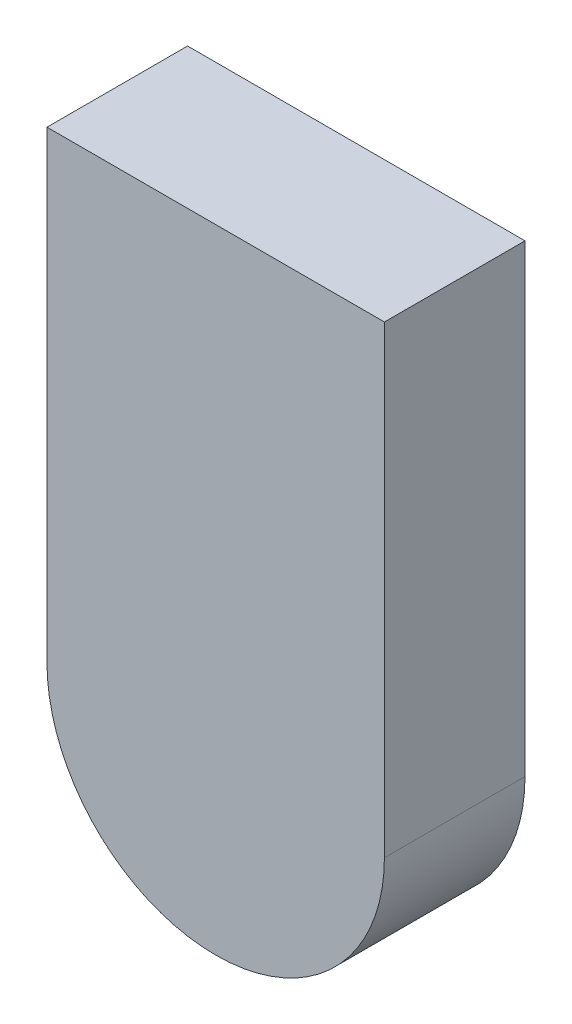
ISO-10303-21;
HEADER;
FILE_DESCRIPTION(('STEP AP214'),'2;1');
FILE_NAME('part.step','',(''),(''),'','','');
FILE_SCHEMA(('AUTOMOTIVE_DESIGN { 1 0 10303 214 1 1 1 1 }'));
ENDSEC;
DATA;
#1=APPLICATION_CONTEXT('core data for automotive mechanical design processes');
#2=APPLICATION_PROTOCOL_DEFINITION('international standard','automotive_design',2000,#1);
#3=PRODUCT_CONTEXT('',#1,'mechanical');
#4=PRODUCT('Part','Part','',(#3));
#5=PRODUCT_RELATED_PRODUCT_CATEGORY('part','',(#4));
#6=PRODUCT_DEFINITION_FORMATION('','',#4);
#7=PRODUCT_DEFINITION_CONTEXT('part definition',#1,'design');
#8=PRODUCT_DEFINITION('design','',#6,#7);
#9=PRODUCT_DEFINITION_SHAPE('','',#8);
#10=(LENGTH_UNIT() NAMED_UNIT(*) SI_UNIT(.MILLI.,.METRE.));
#11=(NAMED_UNIT(*) PLANE_ANGLE_UNIT() SI_UNIT($,.RADIAN.));
#12=(NAMED_UNIT(*) SI_UNIT($,.STERADIAN.) SOLID_ANGLE_UNIT());
#13=UNCERTAINTY_MEASURE_WITH_UNIT(LENGTH_MEASURE(1.E-05),#10,'distance_accuracy_value','');
#14=(GEOMETRIC_REPRESENTATION_CONTEXT(3) GLOBAL_UNCERTAINTY_ASSIGNED_CONTEXT((#13)) GLOBAL_UNIT_ASSIGNED_CONTEXT((#10,
#11,#12)) REPRESENTATION_CONTEXT('',''));
#15=CARTESIAN_POINT('',(0.,0.,0.));
#16=DIRECTION('',(0.,0.,1.));
#17=DIRECTION('',(1.,0.,0.));
#18=AXIS2_PLACEMENT_3D('',#15,#16,#17);
#19=CARTESIAN_POINT('',(-2.37,4.05,0.));
#20=DIRECTION('',(0.,1.,0.));
#21=DIRECTION('',(1.,0.,0.));
#22=AXIS2_PLACEMENT_3D('',#19,#20,#21);
#23=PLANE('',#22);
#24=DIRECTION('',(0.,0.,1.));
#25=VECTOR('',#24,1.);
#26=CARTESIAN_POINT('',(-2.37,4.05,0.));
#27=LINE('',#26,#25);
#28=CARTESIAN_POINT('',(-2.37,4.05,0.));
#29=VERTEX_POINT('',#28);
#30=CARTESIAN_POINT('',(-2.37,4.05,0.1));
#31=VERTEX_POINT('',#30);
#32=EDGE_CURVE('E11',#29,#31,#27,.T.);
#33=ORIENTED_EDGE('',*,*,#32,.T.);
#34=DIRECTION('',(1.,0.,0.));
#35=VECTOR('',#34,1.);
#36=CARTESIAN_POINT('',(-2.37,4.05,0.1));
#37=LINE('',#36,#35);
#38=CARTESIAN_POINT('',(-2.13,4.05,0.1));
#39=VERTEX_POINT('',#38);
#40=EDGE_CURVE('E24',#31,#39,#37,.T.);
#41=ORIENTED_EDGE('',*,*,#40,.T.);
#42=DIRECTION('',(0.,0.,1.));
#43=VECTOR('',#42,1.);
#44=CARTESIAN_POINT('',(-2.13,4.05,0.));
#45=LINE('',#44,#43);
#46=CARTESIAN_POINT('',(-2.13,4.05,0.));
#47=VERTEX_POINT('',#46);
#48=EDGE_CURVE('E85',#47,#39,#45,.T.);
#49=ORIENTED_EDGE('',*,*,#48,.F.);
#50=DIRECTION('',(1.,0.,0.));
#51=VECTOR('',#50,1.);
#52=CARTESIAN_POINT('',(-2.37,4.05,0.));
#53=LINE('',#52,#51);
#54=EDGE_CURVE('E82',#29,#47,#53,.T.);
#55=ORIENTED_EDGE('',*,*,#54,.F.);
#56=EDGE_LOOP('',(#33,#41,#49,#55));
#57=FACE_BOUND('',#56,.T.);
#58=ADVANCED_FACE('F17',(#57),#23,.T.);
#59=CARTESIAN_POINT('',(-2.13,4.05,0.));
#60=DIRECTION('',(1.,0.,0.));
#61=DIRECTION('',(0.,-1.,0.));
#62=AXIS2_PLACEMENT_3D('',#59,#60,#61);
#63=PLANE('',#62);
#64=ORIENTED_EDGE('',*,*,#48,.T.);
#65=DIRECTION('',(0.,-1.,0.));
#66=VECTOR('',#65,1.);
#67=CARTESIAN_POINT('',(-2.13,4.05,0.1));
#68=LINE('',#67,#66);
#69=CARTESIAN_POINT('',(-2.13,3.72,0.1));
#70=VERTEX_POINT('',#69);
#71=EDGE_CURVE('E80',#39,#70,#68,.T.);
#72=ORIENTED_EDGE('',*,*,#71,.T.);
#73=DIRECTION('',(0.,0.,1.));
#74=VECTOR('',#73,1.);
#75=CARTESIAN_POINT('',(-2.13,3.72,0.));
#76=LINE('',#75,#74);
#77=CARTESIAN_POINT('',(-2.13,3.72,0.));
#78=VERTEX_POINT('',#77);
#79=EDGE_CURVE('E60',#78,#70,#76,.T.);
#80=ORIENTED_EDGE('',*,*,#79,.F.);
#81=DIRECTION('',(0.,-1.,0.));
#82=VECTOR('',#81,1.);
#83=CARTESIAN_POINT('',(-2.13,4.05,0.));
#84=LINE('',#83,#82);
#85=EDGE_CURVE('E76',#47,#78,#84,.T.);
#86=ORIENTED_EDGE('',*,*,#85,.F.);
#87=EDGE_LOOP('',(#64,#72,#80,#86));
#88=FACE_BOUND('',#87,.T.);
#89=ADVANCED_FACE('F89',(#88),#63,.T.);
#90=CARTESIAN_POINT('',(-2.25,3.72,0.));
#91=DIRECTION('',(0.,0.,-1.));
#92=DIRECTION('',(1.,0.,0.));
#93=AXIS2_PLACEMENT_3D('',#90,#91,#92);
#94=CYLINDRICAL_SURFACE('',#93,0.12);
#95=CARTESIAN_POINT('',(-2.25,3.72,0.));
#96=DIRECTION('',(0.,0.,1.));
#97=DIRECTION('',(1.,0.,0.));
#98=AXIS2_PLACEMENT_3D('',#95,#96,#97);
#99=CIRCLE('',#98,0.12);
#100=CARTESIAN_POINT('',(-2.37,3.72,0.));
#101=VERTEX_POINT('',#100);
#102=EDGE_CURVE('E64',#101,#78,#99,.T.);
#103=ORIENTED_EDGE('',*,*,#102,.T.);
#104=ORIENTED_EDGE('',*,*,#79,.T.);
#105=CARTESIAN_POINT('',(-2.25,3.72,0.1));
#106=DIRECTION('',(0.,0.,1.));
#107=DIRECTION('',(1.,0.,0.));
#108=AXIS2_PLACEMENT_3D('',#105,#106,#107);
#109=CIRCLE('',#108,0.12);
#110=CARTESIAN_POINT('',(-2.37,3.72,0.1));
#111=VERTEX_POINT('',#110);
#112=EDGE_CURVE('E55',#111,#70,#109,.T.);
#113=ORIENTED_EDGE('',*,*,#112,.F.);
#114=DIRECTION('',(0.,0.,1.));
#115=VECTOR('',#114,1.);
#116=CARTESIAN_POINT('',(-2.37,3.72,0.));
#117=LINE('',#116,#115);
#118=EDGE_CURVE('E59',#101,#111,#117,.T.);
#119=ORIENTED_EDGE('',*,*,#118,.F.);
#120=EDGE_LOOP('',(#103,#104,#113,#119));
#121=FACE_BOUND('',#120,.T.);
#122=ADVANCED_FACE('F58',(#121),#94,.T.);
#123=CARTESIAN_POINT('',(-2.37,4.05,0.));
#124=DIRECTION('',(1.,0.,0.));
#125=DIRECTION('',(0.,-1.,0.));
#126=AXIS2_PLACEMENT_3D('',#123,#124,#125);
#127=PLANE('',#126);
#128=DIRECTION('',(0.,-1.,0.));
#129=VECTOR('',#128,1.);
#130=CARTESIAN_POINT('',(-2.37,4.05,0.));
#131=LINE('',#130,#129);
#132=EDGE_CURVE('E69',#29,#101,#131,.T.);
#133=ORIENTED_EDGE('',*,*,#132,.T.);
#134=ORIENTED_EDGE('',*,*,#118,.T.);
#135=DIRECTION('',(0.,-1.,0.));
#136=VECTOR('',#135,1.);
#137=CARTESIAN_POINT('',(-2.37,4.05,0.1));
#138=LINE('',#137,#136);
#139=EDGE_CURVE('E67',#31,#111,#138,.T.);
#140=ORIENTED_EDGE('',*,*,#139,.F.);
#141=ORIENTED_EDGE('',*,*,#32,.F.);
#142=EDGE_LOOP('',(#133,#134,#140,#141));
#143=FACE_BOUND('',#142,.T.);
#144=ADVANCED_FACE('F66',(#143),#127,.F.);
#145=CARTESIAN_POINT('',(-2.25,3.849490847913,0.));
#146=DIRECTION('',(0.,0.,-1.));
#147=DIRECTION('',(-1.,0.,0.));
#148=AXIS2_PLACEMENT_3D('',#145,#146,#147);
#149=PLANE('',#148);
#150=ORIENTED_EDGE('',*,*,#54,.T.);
#151=ORIENTED_EDGE('',*,*,#85,.T.);
#152=ORIENTED_EDGE('',*,*,#102,.F.);
#153=ORIENTED_EDGE('',*,*,#132,.F.);
#154=EDGE_LOOP('',(#150,#151,#152,#153));
#155=FACE_BOUND('',#154,.T.);
#156=ADVANCED_FACE('F91',(#155),#149,.T.);
#157=CARTESIAN_POINT('',(-2.25,3.849490847913,0.1));
#158=DIRECTION('',(0.,0.,-1.));
#159=DIRECTION('',(-1.,0.,0.));
#160=AXIS2_PLACEMENT_3D('',#157,#158,#159);
#161=PLANE('',#160);
#162=ORIENTED_EDGE('',*,*,#139,.T.);
#163=ORIENTED_EDGE('',*,*,#112,.T.);
#164=ORIENTED_EDGE('',*,*,#71,.F.);
#165=ORIENTED_EDGE('',*,*,#40,.F.);
#166=EDGE_LOOP('',(#162,#163,#164,#165));
#167=FACE_BOUND('',#166,.T.);
#168=ADVANCED_FACE('F71',(#167),#161,.F.);
#169=CLOSED_SHELL('',(#58,#89,#122,#144,#156,#168));
#170=MANIFOLD_SOLID_BREP('B1',#169);
#171=ADVANCED_BREP_SHAPE_REPRESENTATION('',(#18,#170),#14);
#172=SHAPE_DEFINITION_REPRESENTATION(#9,#171);
ENDSEC;
END-ISO-10303-21;
